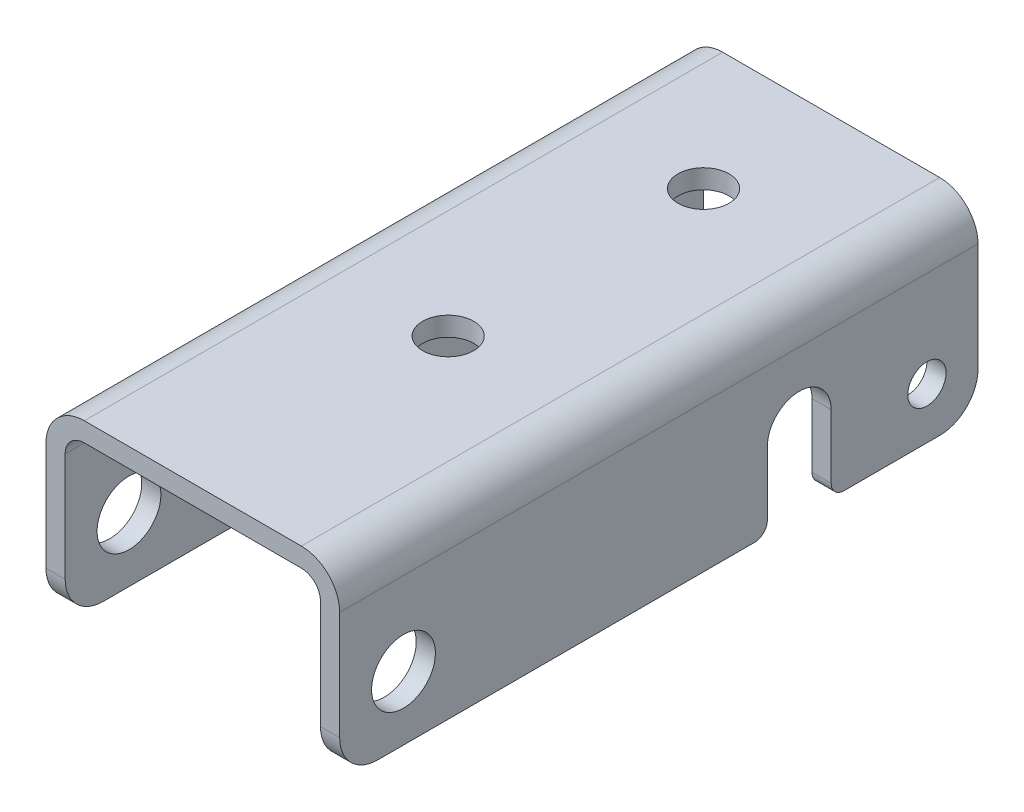
ISO-10303-21;
HEADER;
FILE_DESCRIPTION(('STEP AP214'),'2;1');
FILE_NAME('part.step','',(''),(''),'','','');
FILE_SCHEMA(('AUTOMOTIVE_DESIGN { 1 0 10303 214 1 1 1 1 }'));
ENDSEC;
DATA;
#1=APPLICATION_CONTEXT('core data for automotive mechanical design processes');
#2=APPLICATION_PROTOCOL_DEFINITION('international standard','automotive_design',2000,#1);
#3=PRODUCT_CONTEXT('',#1,'mechanical');
#4=PRODUCT('Part','Part','',(#3));
#5=PRODUCT_RELATED_PRODUCT_CATEGORY('part','',(#4));
#6=PRODUCT_DEFINITION_FORMATION('','',#4);
#7=PRODUCT_DEFINITION_CONTEXT('part definition',#1,'design');
#8=PRODUCT_DEFINITION('design','',#6,#7);
#9=PRODUCT_DEFINITION_SHAPE('','',#8);
#10=(LENGTH_UNIT() NAMED_UNIT(*) SI_UNIT(.MILLI.,.METRE.));
#11=(NAMED_UNIT(*) PLANE_ANGLE_UNIT() SI_UNIT($,.RADIAN.));
#12=(NAMED_UNIT(*) SI_UNIT($,.STERADIAN.) SOLID_ANGLE_UNIT());
#13=UNCERTAINTY_MEASURE_WITH_UNIT(LENGTH_MEASURE(1.E-05),#10,'distance_accuracy_value','');
#14=(GEOMETRIC_REPRESENTATION_CONTEXT(3) GLOBAL_UNCERTAINTY_ASSIGNED_CONTEXT((#13)) GLOBAL_UNIT_ASSIGNED_CONTEXT((#10,
#11,#12)) REPRESENTATION_CONTEXT('',''));
#15=CARTESIAN_POINT('',(0.,0.,0.));
#16=DIRECTION('',(0.,0.,1.));
#17=DIRECTION('',(1.,0.,0.));
#18=AXIS2_PLACEMENT_3D('',#15,#16,#17);
#19=CARTESIAN_POINT('',(10.,6.,-11.));
#20=DIRECTION('',(1.,0.,0.));
#21=DIRECTION('',(0.,1.,0.));
#22=AXIS2_PLACEMENT_3D('',#19,#20,#21);
#23=CYLINDRICAL_SURFACE('',#22,2.5);
#24=DIRECTION('',(-1.,0.,0.));
#25=VECTOR('',#24,1.);
#26=CARTESIAN_POINT('',(10.75,6.,-8.5));
#27=LINE('',#26,#25);
#28=CARTESIAN_POINT('',(11.5,6.,-8.5));
#29=VERTEX_POINT('',#28);
#30=CARTESIAN_POINT('',(10.,6.,-8.5));
#31=VERTEX_POINT('',#30);
#32=EDGE_CURVE('E290',#29,#31,#27,.T.);
#33=ORIENTED_EDGE('',*,*,#32,.T.);
#34=CARTESIAN_POINT('',(10.,6.,-11.));
#35=DIRECTION('',(1.,0.,0.));
#36=DIRECTION('',(0.,1.,0.));
#37=AXIS2_PLACEMENT_3D('',#34,#35,#36);
#38=CIRCLE('',#37,2.5);
#39=CARTESIAN_POINT('',(10.,6.,-13.5));
#40=VERTEX_POINT('',#39);
#41=EDGE_CURVE('E239',#31,#40,#38,.F.);
#42=ORIENTED_EDGE('',*,*,#41,.T.);
#43=DIRECTION('',(1.,0.,0.));
#44=VECTOR('',#43,1.);
#45=CARTESIAN_POINT('',(10.75,6.,-13.5));
#46=LINE('',#45,#44);
#47=CARTESIAN_POINT('',(11.5,6.,-13.5));
#48=VERTEX_POINT('',#47);
#49=EDGE_CURVE('E276',#40,#48,#46,.T.);
#50=ORIENTED_EDGE('',*,*,#49,.T.);
#51=CARTESIAN_POINT('',(11.5,6.,-11.));
#52=DIRECTION('',(1.,0.,0.));
#53=DIRECTION('',(0.,1.,0.));
#54=AXIS2_PLACEMENT_3D('',#51,#52,#53);
#55=CIRCLE('',#54,2.5);
#56=EDGE_CURVE('E397',#48,#29,#55,.T.);
#57=ORIENTED_EDGE('',*,*,#56,.T.);
#58=EDGE_LOOP('',(#33,#42,#50,#57));
#59=FACE_BOUND('',#58,.T.);
#60=ADVANCED_FACE('F17',(#59),#23,.F.);
#61=CARTESIAN_POINT('',(10.,1.,-8.5));
#62=DIRECTION('',(0.,0.,1.));
#63=DIRECTION('',(1.,0.,0.));
#64=AXIS2_PLACEMENT_3D('',#61,#62,#63);
#65=PLANE('',#64);
#66=DIRECTION('',(1.,0.,0.));
#67=VECTOR('',#66,1.);
#68=CARTESIAN_POINT('',(10.75,0.999999999820413,-8.5));
#69=LINE('',#68,#67);
#70=CARTESIAN_POINT('',(11.5,0.999999999910207,-8.5));
#71=VERTEX_POINT('',#70);
#72=CARTESIAN_POINT('',(10.,0.999999999910206,-8.5));
#73=VERTEX_POINT('',#72);
#74=EDGE_CURVE('E288',#71,#73,#69,.F.);
#75=ORIENTED_EDGE('',*,*,#74,.T.);
#76=DIRECTION('',(0.,1.,0.));
#77=VECTOR('',#76,1.);
#78=CARTESIAN_POINT('',(10.,5.75,-8.50000000000001));
#79=LINE('',#78,#77);
#80=EDGE_CURVE('E240',#73,#31,#79,.T.);
#81=ORIENTED_EDGE('',*,*,#80,.T.);
#82=ORIENTED_EDGE('',*,*,#32,.F.);
#83=DIRECTION('',(0.,-1.,0.));
#84=VECTOR('',#83,1.);
#85=CARTESIAN_POINT('',(11.5,5.75,-8.49999999999999));
#86=LINE('',#85,#84);
#87=EDGE_CURVE('E235',#29,#71,#86,.T.);
#88=ORIENTED_EDGE('',*,*,#87,.T.);
#89=EDGE_LOOP('',(#75,#81,#82,#88));
#90=FACE_BOUND('',#89,.T.);
#91=ADVANCED_FACE('F469',(#90),#65,.F.);
#92=CARTESIAN_POINT('',(10.,1.,-7.5));
#93=DIRECTION('',(1.,0.,0.));
#94=DIRECTION('',(0.,1.,0.));
#95=AXIS2_PLACEMENT_3D('',#92,#93,#94);
#96=CYLINDRICAL_SURFACE('',#95,1.);
#97=ORIENTED_EDGE('',*,*,#74,.F.);
#98=CARTESIAN_POINT('',(11.5,1.,-7.5));
#99=DIRECTION('',(1.,0.,0.));
#100=DIRECTION('',(0.,1.,0.));
#101=AXIS2_PLACEMENT_3D('',#98,#99,#100);
#102=CIRCLE('',#101,1.);
#103=CARTESIAN_POINT('',(11.5,0.,-7.5));
#104=VERTEX_POINT('',#103);
#105=EDGE_CURVE('E394',#71,#104,#102,.F.);
#106=ORIENTED_EDGE('',*,*,#105,.T.);
#107=DIRECTION('',(-1.,0.,0.));
#108=VECTOR('',#107,1.);
#109=CARTESIAN_POINT('',(10.75,0.,-7.5));
#110=LINE('',#109,#108);
#111=CARTESIAN_POINT('',(10.,0.,-7.5));
#112=VERTEX_POINT('',#111);
#113=EDGE_CURVE('E285',#104,#112,#110,.T.);
#114=ORIENTED_EDGE('',*,*,#113,.T.);
#115=CARTESIAN_POINT('',(10.,1.,-7.5));
#116=DIRECTION('',(1.,0.,0.));
#117=DIRECTION('',(0.,1.,0.));
#118=AXIS2_PLACEMENT_3D('',#115,#116,#117);
#119=CIRCLE('',#118,1.);
#120=EDGE_CURVE('E243',#112,#73,#119,.T.);
#121=ORIENTED_EDGE('',*,*,#120,.T.);
#122=EDGE_LOOP('',(#97,#106,#114,#121));
#123=FACE_BOUND('',#122,.T.);
#124=ADVANCED_FACE('F466',(#123),#96,.T.);
#125=CARTESIAN_POINT('',(10.,0.,-7.5));
#126=DIRECTION('',(0.,1.,0.));
#127=DIRECTION('',(0.,0.,1.));
#128=AXIS2_PLACEMENT_3D('',#125,#126,#127);
#129=PLANE('',#128);
#130=ORIENTED_EDGE('',*,*,#113,.F.);
#131=DIRECTION('',(0.,0.,1.));
#132=VECTOR('',#131,1.);
#133=CARTESIAN_POINT('',(11.5,0.,0.));
#134=LINE('',#133,#132);
#135=CARTESIAN_POINT('',(11.5,0.,21.999999999423));
#136=VERTEX_POINT('',#135);
#137=EDGE_CURVE('E393',#104,#136,#134,.T.);
#138=ORIENTED_EDGE('',*,*,#137,.T.);
#139=DIRECTION('',(1.,0.,0.));
#140=VECTOR('',#139,1.);
#141=CARTESIAN_POINT('',(10.75,0.,21.9999999988459));
#142=LINE('',#141,#140);
#143=CARTESIAN_POINT('',(10.,0.,21.999999999423));
#144=VERTEX_POINT('',#143);
#145=EDGE_CURVE('E282',#136,#144,#142,.F.);
#146=ORIENTED_EDGE('',*,*,#145,.T.);
#147=DIRECTION('',(0.,0.,-1.));
#148=VECTOR('',#147,1.);
#149=CARTESIAN_POINT('',(10.,0.,0.));
#150=LINE('',#149,#148);
#151=EDGE_CURVE('E244',#144,#112,#150,.T.);
#152=ORIENTED_EDGE('',*,*,#151,.T.);
#153=EDGE_LOOP('',(#130,#138,#146,#152));
#154=FACE_BOUND('',#153,.T.);
#155=ADVANCED_FACE('F457',(#154),#129,.F.);
#156=CARTESIAN_POINT('',(11.5,3.,22.));
#157=DIRECTION('',(-1.,0.,0.));
#158=DIRECTION('',(0.,0.,1.));
#159=AXIS2_PLACEMENT_3D('',#156,#157,#158);
#160=CYLINDRICAL_SURFACE('',#159,3.);
#161=ORIENTED_EDGE('',*,*,#145,.F.);
#162=CARTESIAN_POINT('',(11.5,3.,22.));
#163=DIRECTION('',(-1.,0.,0.));
#164=DIRECTION('',(0.,0.,1.));
#165=AXIS2_PLACEMENT_3D('',#162,#163,#164);
#166=CIRCLE('',#165,3.);
#167=CARTESIAN_POINT('',(11.5,2.99999999973062,25.));
#168=VERTEX_POINT('',#167);
#169=EDGE_CURVE('E390',#136,#168,#166,.T.);
#170=ORIENTED_EDGE('',*,*,#169,.T.);
#171=DIRECTION('',(-1.,0.,0.));
#172=VECTOR('',#171,1.);
#173=CARTESIAN_POINT('',(10.75,2.99999999946124,25.));
#174=LINE('',#173,#172);
#175=CARTESIAN_POINT('',(10.0000000035,2.99999999973062,25.));
#176=VERTEX_POINT('',#175);
#177=EDGE_CURVE('E283',#176,#168,#174,.F.);
#178=ORIENTED_EDGE('',*,*,#177,.F.);
#179=CARTESIAN_POINT('',(10.,3.,22.));
#180=DIRECTION('',(-1.,0.,0.));
#181=DIRECTION('',(0.,0.,1.));
#182=AXIS2_PLACEMENT_3D('',#179,#180,#181);
#183=CIRCLE('',#182,3.);
#184=EDGE_CURVE('E211',#176,#144,#183,.F.);
#185=ORIENTED_EDGE('',*,*,#184,.T.);
#186=EDGE_LOOP('',(#161,#170,#178,#185));
#187=FACE_BOUND('',#186,.T.);
#188=ADVANCED_FACE('F408',(#187),#160,.T.);
#189=CARTESIAN_POINT('',(10.,3.,-22.));
#190=DIRECTION('',(1.,0.,0.));
#191=DIRECTION('',(0.,1.,0.));
#192=AXIS2_PLACEMENT_3D('',#189,#190,#191);
#193=CYLINDRICAL_SURFACE('',#192,3.);
#194=DIRECTION('',(1.,0.,0.));
#195=VECTOR('',#194,1.);
#196=CARTESIAN_POINT('',(10.75,2.99999999946124,-25.));
#197=LINE('',#196,#195);
#198=CARTESIAN_POINT('',(11.5,2.99999999973062,-25.));
#199=VERTEX_POINT('',#198);
#200=CARTESIAN_POINT('',(10.0000000035,2.99999999973062,-25.));
#201=VERTEX_POINT('',#200);
#202=EDGE_CURVE('E222',#199,#201,#197,.F.);
#203=ORIENTED_EDGE('',*,*,#202,.F.);
#204=CARTESIAN_POINT('',(11.5,3.,-22.));
#205=DIRECTION('',(1.,0.,0.));
#206=DIRECTION('',(0.,1.,0.));
#207=AXIS2_PLACEMENT_3D('',#204,#205,#206);
#208=CIRCLE('',#207,3.);
#209=CARTESIAN_POINT('',(11.5,0.,-22.));
#210=VERTEX_POINT('',#209);
#211=EDGE_CURVE('E217',#199,#210,#208,.F.);
#212=ORIENTED_EDGE('',*,*,#211,.T.);
#213=DIRECTION('',(-1.,0.,0.));
#214=VECTOR('',#213,1.);
#215=CARTESIAN_POINT('',(10.75,0.,-22.));
#216=LINE('',#215,#214);
#217=CARTESIAN_POINT('',(10.,0.,-22.));
#218=VERTEX_POINT('',#217);
#219=EDGE_CURVE('E214',#210,#218,#216,.T.);
#220=ORIENTED_EDGE('',*,*,#219,.T.);
#221=CARTESIAN_POINT('',(10.,3.,-22.));
#222=DIRECTION('',(1.,0.,0.));
#223=DIRECTION('',(0.,1.,0.));
#224=AXIS2_PLACEMENT_3D('',#221,#222,#223);
#225=CIRCLE('',#224,3.);
#226=EDGE_CURVE('E21',#218,#201,#225,.T.);
#227=ORIENTED_EDGE('',*,*,#226,.T.);
#228=EDGE_LOOP('',(#203,#212,#220,#227));
#229=FACE_BOUND('',#228,.T.);
#230=ADVANCED_FACE('F215',(#229),#193,.T.);
#231=CARTESIAN_POINT('',(10.,0.,-22.));
#232=DIRECTION('',(0.,1.,0.));
#233=DIRECTION('',(0.,0.,1.));
#234=AXIS2_PLACEMENT_3D('',#231,#232,#233);
#235=PLANE('',#234);
#236=DIRECTION('',(1.,0.,0.));
#237=VECTOR('',#236,1.);
#238=CARTESIAN_POINT('',(10.75,0.,-14.4999999996153));
#239=LINE('',#238,#237);
#240=CARTESIAN_POINT('',(11.5,0.,-14.4999999998077));
#241=VERTEX_POINT('',#240);
#242=CARTESIAN_POINT('',(10.,0.,-14.4999999998077));
#243=VERTEX_POINT('',#242);
#244=EDGE_CURVE('E221',#241,#243,#239,.F.);
#245=ORIENTED_EDGE('',*,*,#244,.T.);
#246=DIRECTION('',(0.,0.,-1.));
#247=VECTOR('',#246,1.);
#248=CARTESIAN_POINT('',(10.,0.,0.));
#249=LINE('',#248,#247);
#250=EDGE_CURVE('E206',#243,#218,#249,.T.);
#251=ORIENTED_EDGE('',*,*,#250,.T.);
#252=ORIENTED_EDGE('',*,*,#219,.F.);
#253=DIRECTION('',(0.,0.,1.));
#254=VECTOR('',#253,1.);
#255=CARTESIAN_POINT('',(11.5,0.,0.));
#256=LINE('',#255,#254);
#257=EDGE_CURVE('E388',#210,#241,#256,.T.);
#258=ORIENTED_EDGE('',*,*,#257,.T.);
#259=EDGE_LOOP('',(#245,#251,#252,#258));
#260=FACE_BOUND('',#259,.T.);
#261=ADVANCED_FACE('F224',(#260),#235,.F.);
#262=CARTESIAN_POINT('',(10.,1.,-14.5));
#263=DIRECTION('',(1.,0.,0.));
#264=DIRECTION('',(0.,1.,0.));
#265=AXIS2_PLACEMENT_3D('',#262,#263,#264);
#266=CYLINDRICAL_SURFACE('',#265,0.999999999999999);
#267=ORIENTED_EDGE('',*,*,#244,.F.);
#268=CARTESIAN_POINT('',(11.5,1.,-14.5));
#269=DIRECTION('',(1.,0.,0.));
#270=DIRECTION('',(0.,1.,0.));
#271=AXIS2_PLACEMENT_3D('',#268,#269,#270);
#272=CIRCLE('',#271,0.999999999999999);
#273=CARTESIAN_POINT('',(11.5,1.,-13.5));
#274=VERTEX_POINT('',#273);
#275=EDGE_CURVE('E385',#241,#274,#272,.F.);
#276=ORIENTED_EDGE('',*,*,#275,.T.);
#277=DIRECTION('',(-1.,0.,0.));
#278=VECTOR('',#277,1.);
#279=CARTESIAN_POINT('',(10.75,1.,-13.5));
#280=LINE('',#279,#278);
#281=CARTESIAN_POINT('',(10.,1.,-13.5));
#282=VERTEX_POINT('',#281);
#283=EDGE_CURVE('E274',#274,#282,#280,.T.);
#284=ORIENTED_EDGE('',*,*,#283,.T.);
#285=CARTESIAN_POINT('',(10.,1.,-14.5));
#286=DIRECTION('',(1.,0.,0.));
#287=DIRECTION('',(0.,1.,0.));
#288=AXIS2_PLACEMENT_3D('',#285,#286,#287);
#289=CIRCLE('',#288,0.999999999999999);
#290=EDGE_CURVE('E226',#282,#243,#289,.T.);
#291=ORIENTED_EDGE('',*,*,#290,.T.);
#292=EDGE_LOOP('',(#267,#276,#284,#291));
#293=FACE_BOUND('',#292,.T.);
#294=ADVANCED_FACE('F476',(#293),#266,.T.);
#295=CARTESIAN_POINT('',(11.5,1.,-13.5));
#296=DIRECTION('',(0.,0.,-1.));
#297=DIRECTION('',(-1.,0.,0.));
#298=AXIS2_PLACEMENT_3D('',#295,#296,#297);
#299=PLANE('',#298);
#300=ORIENTED_EDGE('',*,*,#283,.F.);
#301=DIRECTION('',(0.,1.,0.));
#302=VECTOR('',#301,1.);
#303=CARTESIAN_POINT('',(11.5,5.75,-13.5));
#304=LINE('',#303,#302);
#305=EDGE_CURVE('E384',#274,#48,#304,.T.);
#306=ORIENTED_EDGE('',*,*,#305,.T.);
#307=ORIENTED_EDGE('',*,*,#49,.F.);
#308=DIRECTION('',(0.,-1.,0.));
#309=VECTOR('',#308,1.);
#310=CARTESIAN_POINT('',(10.,5.75,-13.5));
#311=LINE('',#310,#309);
#312=EDGE_CURVE('E231',#40,#282,#311,.T.);
#313=ORIENTED_EDGE('',*,*,#312,.T.);
#314=EDGE_LOOP('',(#300,#306,#307,#313));
#315=FACE_BOUND('',#314,.T.);
#316=ADVANCED_FACE('F477',(#315),#299,.F.);
#317=CARTESIAN_POINT('',(10.,4.,-21.));
#318=DIRECTION('',(1.,0.,0.));
#319=DIRECTION('',(0.,1.,0.));
#320=AXIS2_PLACEMENT_3D('',#317,#318,#319);
#321=CYLINDRICAL_SURFACE('',#320,1.5);
#322=CARTESIAN_POINT('',(10.,4.,-21.));
#323=DIRECTION('',(1.,0.,0.));
#324=DIRECTION('',(0.,1.,0.));
#325=AXIS2_PLACEMENT_3D('',#322,#323,#324);
#326=CIRCLE('',#325,1.5);
#327=CARTESIAN_POINT('',(10.,5.5,-21.));
#328=VERTEX_POINT('',#327);
#329=EDGE_CURVE('E225',#328,#328,#326,.F.);
#330=ORIENTED_EDGE('',*,*,#329,.T.);
#331=EDGE_LOOP('',(#330));
#332=FACE_BOUND('',#331,.T.);
#333=CARTESIAN_POINT('',(11.5,4.,-21.));
#334=DIRECTION('',(1.,0.,0.));
#335=DIRECTION('',(0.,1.,0.));
#336=AXIS2_PLACEMENT_3D('',#333,#334,#335);
#337=CIRCLE('',#336,1.5);
#338=CARTESIAN_POINT('',(11.5,5.5,-21.));
#339=VERTEX_POINT('',#338);
#340=EDGE_CURVE('E381',#339,#339,#337,.T.);
#341=ORIENTED_EDGE('',*,*,#340,.T.);
#342=EDGE_LOOP('',(#341));
#343=FACE_BOUND('',#342,.T.);
#344=ADVANCED_FACE('F479',(#332,#343),#321,.F.);
#345=CARTESIAN_POINT('',(10.,5.,20.));
#346=DIRECTION('',(1.,0.,0.));
#347=DIRECTION('',(0.,1.,0.));
#348=AXIS2_PLACEMENT_3D('',#345,#346,#347);
#349=CYLINDRICAL_SURFACE('',#348,2.5);
#350=CARTESIAN_POINT('',(10.,5.,20.));
#351=DIRECTION('',(1.,0.,0.));
#352=DIRECTION('',(0.,1.,0.));
#353=AXIS2_PLACEMENT_3D('',#350,#351,#352);
#354=CIRCLE('',#353,2.5);
#355=CARTESIAN_POINT('',(10.,7.5,20.));
#356=VERTEX_POINT('',#355);
#357=EDGE_CURVE('E229',#356,#356,#354,.F.);
#358=ORIENTED_EDGE('',*,*,#357,.T.);
#359=EDGE_LOOP('',(#358));
#360=FACE_BOUND('',#359,.T.);
#361=CARTESIAN_POINT('',(11.5,5.,20.));
#362=DIRECTION('',(1.,0.,0.));
#363=DIRECTION('',(0.,1.,0.));
#364=AXIS2_PLACEMENT_3D('',#361,#362,#363);
#365=CIRCLE('',#364,2.5);
#366=CARTESIAN_POINT('',(11.5,7.5,20.));
#367=VERTEX_POINT('',#366);
#368=EDGE_CURVE('E378',#367,#367,#365,.T.);
#369=ORIENTED_EDGE('',*,*,#368,.T.);
#370=EDGE_LOOP('',(#369));
#371=FACE_BOUND('',#370,.T.);
#372=ADVANCED_FACE('F486',(#360,#371),#349,.F.);
#373=CARTESIAN_POINT('',(-11.5,6.,-11.));
#374=DIRECTION('',(1.,0.,0.));
#375=DIRECTION('',(0.,0.,-1.));
#376=AXIS2_PLACEMENT_3D('',#373,#374,#375);
#377=CYLINDRICAL_SURFACE('',#376,2.5);
#378=DIRECTION('',(1.,0.,0.));
#379=VECTOR('',#378,1.);
#380=CARTESIAN_POINT('',(-10.75,6.,-13.5));
#381=LINE('',#380,#379);
#382=CARTESIAN_POINT('',(-11.5,6.,-13.5));
#383=VERTEX_POINT('',#382);
#384=CARTESIAN_POINT('',(-10.,6.,-13.5));
#385=VERTEX_POINT('',#384);
#386=EDGE_CURVE('E254',#383,#385,#381,.T.);
#387=ORIENTED_EDGE('',*,*,#386,.T.);
#388=CARTESIAN_POINT('',(-10.,6.,-11.));
#389=DIRECTION('',(1.,0.,0.));
#390=DIRECTION('',(0.,0.,-1.));
#391=AXIS2_PLACEMENT_3D('',#388,#389,#390);
#392=CIRCLE('',#391,2.5);
#393=CARTESIAN_POINT('',(-10.,6.,-8.5));
#394=VERTEX_POINT('',#393);
#395=EDGE_CURVE('E350',#385,#394,#392,.T.);
#396=ORIENTED_EDGE('',*,*,#395,.T.);
#397=DIRECTION('',(-1.,0.,0.));
#398=VECTOR('',#397,1.);
#399=CARTESIAN_POINT('',(-10.75,6.,-8.5));
#400=LINE('',#399,#398);
#401=CARTESIAN_POINT('',(-11.5,6.,-8.5));
#402=VERTEX_POINT('',#401);
#403=EDGE_CURVE('E272',#394,#402,#400,.T.);
#404=ORIENTED_EDGE('',*,*,#403,.T.);
#405=CARTESIAN_POINT('',(-11.5,6.,-11.));
#406=DIRECTION('',(1.,0.,0.));
#407=DIRECTION('',(0.,0.,-1.));
#408=AXIS2_PLACEMENT_3D('',#405,#406,#407);
#409=CIRCLE('',#408,2.5);
#410=EDGE_CURVE('E364',#402,#383,#409,.F.);
#411=ORIENTED_EDGE('',*,*,#410,.T.);
#412=EDGE_LOOP('',(#387,#396,#404,#411));
#413=FACE_BOUND('',#412,.T.);
#414=ADVANCED_FACE('F553',(#413),#377,.F.);
#415=CARTESIAN_POINT('',(-11.5,1.,-8.5));
#416=DIRECTION('',(0.,0.,1.));
#417=DIRECTION('',(1.,0.,0.));
#418=AXIS2_PLACEMENT_3D('',#415,#416,#417);
#419=PLANE('',#418);
#420=DIRECTION('',(1.,0.,0.));
#421=VECTOR('',#420,1.);
#422=CARTESIAN_POINT('',(-10.75,0.999999999820413,-8.5));
#423=LINE('',#422,#421);
#424=CARTESIAN_POINT('',(-10.,0.999999999910206,-8.5));
#425=VERTEX_POINT('',#424);
#426=CARTESIAN_POINT('',(-11.5,0.999999999910206,-8.5));
#427=VERTEX_POINT('',#426);
#428=EDGE_CURVE('E270',#425,#427,#423,.F.);
#429=ORIENTED_EDGE('',*,*,#428,.T.);
#430=DIRECTION('',(0.,1.,0.));
#431=VECTOR('',#430,1.);
#432=CARTESIAN_POINT('',(-11.5,5.75,-8.50000000000001));
#433=LINE('',#432,#431);
#434=EDGE_CURVE('E367',#427,#402,#433,.T.);
#435=ORIENTED_EDGE('',*,*,#434,.T.);
#436=ORIENTED_EDGE('',*,*,#403,.F.);
#437=DIRECTION('',(0.,-1.,0.));
#438=VECTOR('',#437,1.);
#439=CARTESIAN_POINT('',(-10.,5.75,-8.49999999999999));
#440=LINE('',#439,#438);
#441=EDGE_CURVE('E349',#394,#425,#440,.T.);
#442=ORIENTED_EDGE('',*,*,#441,.T.);
#443=EDGE_LOOP('',(#429,#435,#436,#442));
#444=FACE_BOUND('',#443,.T.);
#445=ADVANCED_FACE('F551',(#444),#419,.F.);
#446=CARTESIAN_POINT('',(-11.5,1.,-7.5));
#447=DIRECTION('',(1.,0.,0.));
#448=DIRECTION('',(0.,0.,-1.));
#449=AXIS2_PLACEMENT_3D('',#446,#447,#448);
#450=CYLINDRICAL_SURFACE('',#449,1.);
#451=ORIENTED_EDGE('',*,*,#428,.F.);
#452=CARTESIAN_POINT('',(-10.,1.,-7.5));
#453=DIRECTION('',(1.,0.,0.));
#454=DIRECTION('',(0.,0.,-1.));
#455=AXIS2_PLACEMENT_3D('',#452,#453,#454);
#456=CIRCLE('',#455,1.);
#457=CARTESIAN_POINT('',(-10.,0.,-7.5));
#458=VERTEX_POINT('',#457);
#459=EDGE_CURVE('E346',#425,#458,#456,.F.);
#460=ORIENTED_EDGE('',*,*,#459,.T.);
#461=DIRECTION('',(-1.,0.,0.));
#462=VECTOR('',#461,1.);
#463=CARTESIAN_POINT('',(-10.75,0.,-7.5));
#464=LINE('',#463,#462);
#465=CARTESIAN_POINT('',(-11.5,0.,-7.5));
#466=VERTEX_POINT('',#465);
#467=EDGE_CURVE('E267',#458,#466,#464,.T.);
#468=ORIENTED_EDGE('',*,*,#467,.T.);
#469=CARTESIAN_POINT('',(-11.5,1.,-7.5));
#470=DIRECTION('',(1.,0.,0.));
#471=DIRECTION('',(0.,0.,-1.));
#472=AXIS2_PLACEMENT_3D('',#469,#470,#471);
#473=CIRCLE('',#472,1.);
#474=EDGE_CURVE('E368',#466,#427,#473,.T.);
#475=ORIENTED_EDGE('',*,*,#474,.T.);
#476=EDGE_LOOP('',(#451,#460,#468,#475));
#477=FACE_BOUND('',#476,.T.);
#478=ADVANCED_FACE('F548',(#477),#450,.T.);
#479=CARTESIAN_POINT('',(-11.5,0.,-7.5));
#480=DIRECTION('',(0.,1.,0.));
#481=DIRECTION('',(0.,0.,1.));
#482=AXIS2_PLACEMENT_3D('',#479,#480,#481);
#483=PLANE('',#482);
#484=ORIENTED_EDGE('',*,*,#467,.F.);
#485=DIRECTION('',(0.,0.,1.));
#486=VECTOR('',#485,1.);
#487=CARTESIAN_POINT('',(-10.,0.,0.));
#488=LINE('',#487,#486);
#489=CARTESIAN_POINT('',(-10.,0.,21.999999999423));
#490=VERTEX_POINT('',#489);
#491=EDGE_CURVE('E345',#458,#490,#488,.T.);
#492=ORIENTED_EDGE('',*,*,#491,.T.);
#493=DIRECTION('',(1.,0.,0.));
#494=VECTOR('',#493,1.);
#495=CARTESIAN_POINT('',(-10.75,0.,21.9999999988459));
#496=LINE('',#495,#494);
#497=CARTESIAN_POINT('',(-11.5,0.,21.999999999423));
#498=VERTEX_POINT('',#497);
#499=EDGE_CURVE('E264',#490,#498,#496,.F.);
#500=ORIENTED_EDGE('',*,*,#499,.T.);
#501=DIRECTION('',(0.,0.,-1.));
#502=VECTOR('',#501,1.);
#503=CARTESIAN_POINT('',(-11.5,0.,0.));
#504=LINE('',#503,#502);
#505=EDGE_CURVE('E371',#498,#466,#504,.T.);
#506=ORIENTED_EDGE('',*,*,#505,.T.);
#507=EDGE_LOOP('',(#484,#492,#500,#506));
#508=FACE_BOUND('',#507,.T.);
#509=ADVANCED_FACE('F546',(#508),#483,.F.);
#510=CARTESIAN_POINT('',(-10.,3.,22.));
#511=DIRECTION('',(-1.,0.,0.));
#512=DIRECTION('',(0.,-1.,0.));
#513=AXIS2_PLACEMENT_3D('',#510,#511,#512);
#514=CYLINDRICAL_SURFACE('',#513,3.);
#515=ORIENTED_EDGE('',*,*,#499,.F.);
#516=CARTESIAN_POINT('',(-10.,3.,22.));
#517=DIRECTION('',(-1.,0.,0.));
#518=DIRECTION('',(0.,-1.,0.));
#519=AXIS2_PLACEMENT_3D('',#516,#517,#518);
#520=CIRCLE('',#519,3.);
#521=CARTESIAN_POINT('',(-10.0000000035,2.99999999973062,25.));
#522=VERTEX_POINT('',#521);
#523=EDGE_CURVE('E342',#490,#522,#520,.T.);
#524=ORIENTED_EDGE('',*,*,#523,.T.);
#525=DIRECTION('',(-1.,0.,0.));
#526=VECTOR('',#525,1.);
#527=CARTESIAN_POINT('',(-10.75,2.99999999946124,25.));
#528=LINE('',#527,#526);
#529=CARTESIAN_POINT('',(-11.5,2.99999999973062,25.));
#530=VERTEX_POINT('',#529);
#531=EDGE_CURVE('E265',#530,#522,#528,.F.);
#532=ORIENTED_EDGE('',*,*,#531,.F.);
#533=CARTESIAN_POINT('',(-11.5,3.,22.));
#534=DIRECTION('',(-1.,0.,0.));
#535=DIRECTION('',(0.,-1.,0.));
#536=AXIS2_PLACEMENT_3D('',#533,#534,#535);
#537=CIRCLE('',#536,3.);
#538=EDGE_CURVE('E372',#530,#498,#537,.F.);
#539=ORIENTED_EDGE('',*,*,#538,.T.);
#540=EDGE_LOOP('',(#515,#524,#532,#539));
#541=FACE_BOUND('',#540,.T.);
#542=ADVANCED_FACE('F542',(#541),#514,.T.);
#543=CARTESIAN_POINT('',(-11.5,3.,-22.));
#544=DIRECTION('',(1.,0.,0.));
#545=DIRECTION('',(0.,0.,-1.));
#546=AXIS2_PLACEMENT_3D('',#543,#544,#545);
#547=CYLINDRICAL_SURFACE('',#546,3.);
#548=DIRECTION('',(1.,0.,0.));
#549=VECTOR('',#548,1.);
#550=CARTESIAN_POINT('',(-10.75,2.99999999946124,-25.));
#551=LINE('',#550,#549);
#552=CARTESIAN_POINT('',(-10.0000000035,2.99999999973062,-25.));
#553=VERTEX_POINT('',#552);
#554=CARTESIAN_POINT('',(-11.5,2.99999999973062,-25.));
#555=VERTEX_POINT('',#554);
#556=EDGE_CURVE('E262',#553,#555,#551,.F.);
#557=ORIENTED_EDGE('',*,*,#556,.F.);
#558=CARTESIAN_POINT('',(-10.,3.,-22.));
#559=DIRECTION('',(1.,0.,0.));
#560=DIRECTION('',(0.,0.,-1.));
#561=AXIS2_PLACEMENT_3D('',#558,#559,#560);
#562=CIRCLE('',#561,3.);
#563=CARTESIAN_POINT('',(-10.,0.,-22.));
#564=VERTEX_POINT('',#563);
#565=EDGE_CURVE('E339',#553,#564,#562,.F.);
#566=ORIENTED_EDGE('',*,*,#565,.T.);
#567=DIRECTION('',(-1.,0.,0.));
#568=VECTOR('',#567,1.);
#569=CARTESIAN_POINT('',(-10.75,0.,-22.));
#570=LINE('',#569,#568);
#571=CARTESIAN_POINT('',(-11.5,0.,-22.));
#572=VERTEX_POINT('',#571);
#573=EDGE_CURVE('E259',#564,#572,#570,.T.);
#574=ORIENTED_EDGE('',*,*,#573,.T.);
#575=CARTESIAN_POINT('',(-11.5,3.,-22.));
#576=DIRECTION('',(1.,0.,0.));
#577=DIRECTION('',(0.,0.,-1.));
#578=AXIS2_PLACEMENT_3D('',#575,#576,#577);
#579=CIRCLE('',#578,3.);
#580=EDGE_CURVE('E375',#572,#555,#579,.T.);
#581=ORIENTED_EDGE('',*,*,#580,.T.);
#582=EDGE_LOOP('',(#557,#566,#574,#581));
#583=FACE_BOUND('',#582,.T.);
#584=ADVANCED_FACE('F539',(#583),#547,.T.);
#585=CARTESIAN_POINT('',(-11.5,0.,-22.));
#586=DIRECTION('',(0.,1.,0.));
#587=DIRECTION('',(0.,0.,1.));
#588=AXIS2_PLACEMENT_3D('',#585,#586,#587);
#589=PLANE('',#588);
#590=DIRECTION('',(1.,0.,0.));
#591=VECTOR('',#590,1.);
#592=CARTESIAN_POINT('',(-10.75,0.,-14.4999999996153));
#593=LINE('',#592,#591);
#594=CARTESIAN_POINT('',(-10.,0.,-14.4999999998077));
#595=VERTEX_POINT('',#594);
#596=CARTESIAN_POINT('',(-11.5,0.,-14.4999999998077));
#597=VERTEX_POINT('',#596);
#598=EDGE_CURVE('E257',#595,#597,#593,.F.);
#599=ORIENTED_EDGE('',*,*,#598,.T.);
#600=DIRECTION('',(0.,0.,-1.));
#601=VECTOR('',#600,1.);
#602=CARTESIAN_POINT('',(-11.5,0.,0.));
#603=LINE('',#602,#601);
#604=EDGE_CURVE('E359',#597,#572,#603,.T.);
#605=ORIENTED_EDGE('',*,*,#604,.T.);
#606=ORIENTED_EDGE('',*,*,#573,.F.);
#607=DIRECTION('',(0.,0.,1.));
#608=VECTOR('',#607,1.);
#609=CARTESIAN_POINT('',(-10.,0.,0.));
#610=LINE('',#609,#608);
#611=EDGE_CURVE('E338',#564,#595,#610,.T.);
#612=ORIENTED_EDGE('',*,*,#611,.T.);
#613=EDGE_LOOP('',(#599,#605,#606,#612));
#614=FACE_BOUND('',#613,.T.);
#615=ADVANCED_FACE('F537',(#614),#589,.F.);
#616=CARTESIAN_POINT('',(-11.5,1.,-14.5));
#617=DIRECTION('',(1.,0.,0.));
#618=DIRECTION('',(0.,0.,-1.));
#619=AXIS2_PLACEMENT_3D('',#616,#617,#618);
#620=CYLINDRICAL_SURFACE('',#619,0.999999999999999);
#621=ORIENTED_EDGE('',*,*,#598,.F.);
#622=CARTESIAN_POINT('',(-10.,1.,-14.5));
#623=DIRECTION('',(1.,0.,0.));
#624=DIRECTION('',(0.,0.,-1.));
#625=AXIS2_PLACEMENT_3D('',#622,#623,#624);
#626=CIRCLE('',#625,0.999999999999999);
#627=CARTESIAN_POINT('',(-10.,1.,-13.5));
#628=VERTEX_POINT('',#627);
#629=EDGE_CURVE('E335',#595,#628,#626,.F.);
#630=ORIENTED_EDGE('',*,*,#629,.T.);
#631=DIRECTION('',(-1.,0.,0.));
#632=VECTOR('',#631,1.);
#633=CARTESIAN_POINT('',(-10.75,1.,-13.5));
#634=LINE('',#633,#632);
#635=CARTESIAN_POINT('',(-11.5,1.,-13.5));
#636=VERTEX_POINT('',#635);
#637=EDGE_CURVE('E212',#628,#636,#634,.T.);
#638=ORIENTED_EDGE('',*,*,#637,.T.);
#639=CARTESIAN_POINT('',(-11.5,1.,-14.5));
#640=DIRECTION('',(1.,0.,0.));
#641=DIRECTION('',(0.,0.,-1.));
#642=AXIS2_PLACEMENT_3D('',#639,#640,#641);
#643=CIRCLE('',#642,0.999999999999999);
#644=EDGE_CURVE('E360',#636,#597,#643,.T.);
#645=ORIENTED_EDGE('',*,*,#644,.T.);
#646=EDGE_LOOP('',(#621,#630,#638,#645));
#647=FACE_BOUND('',#646,.T.);
#648=ADVANCED_FACE('F534',(#647),#620,.T.);
#649=CARTESIAN_POINT('',(-10.,1.,-13.5));
#650=DIRECTION('',(0.,0.,-1.));
#651=DIRECTION('',(-1.,0.,0.));
#652=AXIS2_PLACEMENT_3D('',#649,#650,#651);
#653=PLANE('',#652);
#654=ORIENTED_EDGE('',*,*,#637,.F.);
#655=DIRECTION('',(0.,1.,0.));
#656=VECTOR('',#655,1.);
#657=CARTESIAN_POINT('',(-10.,5.75,-13.5));
#658=LINE('',#657,#656);
#659=EDGE_CURVE('E334',#628,#385,#658,.T.);
#660=ORIENTED_EDGE('',*,*,#659,.T.);
#661=ORIENTED_EDGE('',*,*,#386,.F.);
#662=DIRECTION('',(0.,-1.,0.));
#663=VECTOR('',#662,1.);
#664=CARTESIAN_POINT('',(-11.5,5.75,-13.5));
#665=LINE('',#664,#663);
#666=EDGE_CURVE('E363',#383,#636,#665,.T.);
#667=ORIENTED_EDGE('',*,*,#666,.T.);
#668=EDGE_LOOP('',(#654,#660,#661,#667));
#669=FACE_BOUND('',#668,.T.);
#670=ADVANCED_FACE('F532',(#669),#653,.F.);
#671=CARTESIAN_POINT('',(-11.5,4.,-21.));
#672=DIRECTION('',(1.,0.,0.));
#673=DIRECTION('',(0.,0.,-1.));
#674=AXIS2_PLACEMENT_3D('',#671,#672,#673);
#675=CYLINDRICAL_SURFACE('',#674,1.5);
#676=CARTESIAN_POINT('',(-10.,4.,-21.));
#677=DIRECTION('',(1.,0.,0.));
#678=DIRECTION('',(0.,0.,-1.));
#679=AXIS2_PLACEMENT_3D('',#676,#677,#678);
#680=CIRCLE('',#679,1.5);
#681=CARTESIAN_POINT('',(-10.,4.,-22.5));
#682=VERTEX_POINT('',#681);
#683=EDGE_CURVE('E331',#682,#682,#680,.T.);
#684=ORIENTED_EDGE('',*,*,#683,.T.);
#685=EDGE_LOOP('',(#684));
#686=FACE_BOUND('',#685,.T.);
#687=CARTESIAN_POINT('',(-11.5,4.,-21.));
#688=DIRECTION('',(1.,0.,0.));
#689=DIRECTION('',(0.,0.,-1.));
#690=AXIS2_PLACEMENT_3D('',#687,#688,#689);
#691=CIRCLE('',#690,1.5);
#692=CARTESIAN_POINT('',(-11.5,4.,-22.5));
#693=VERTEX_POINT('',#692);
#694=EDGE_CURVE('E356',#693,#693,#691,.F.);
#695=ORIENTED_EDGE('',*,*,#694,.T.);
#696=EDGE_LOOP('',(#695));
#697=FACE_BOUND('',#696,.T.);
#698=ADVANCED_FACE('F528',(#686,#697),#675,.F.);
#699=CARTESIAN_POINT('',(-11.5,5.,20.));
#700=DIRECTION('',(1.,0.,0.));
#701=DIRECTION('',(0.,0.,-1.));
#702=AXIS2_PLACEMENT_3D('',#699,#700,#701);
#703=CYLINDRICAL_SURFACE('',#702,2.5);
#704=CARTESIAN_POINT('',(-10.,5.,20.));
#705=DIRECTION('',(1.,0.,0.));
#706=DIRECTION('',(0.,0.,-1.));
#707=AXIS2_PLACEMENT_3D('',#704,#705,#706);
#708=CIRCLE('',#707,2.5);
#709=CARTESIAN_POINT('',(-10.,5.,17.5));
#710=VERTEX_POINT('',#709);
#711=EDGE_CURVE('E252',#710,#710,#708,.T.);
#712=ORIENTED_EDGE('',*,*,#711,.T.);
#713=EDGE_LOOP('',(#712));
#714=FACE_BOUND('',#713,.T.);
#715=CARTESIAN_POINT('',(-11.5,5.,20.));
#716=DIRECTION('',(1.,0.,0.));
#717=DIRECTION('',(0.,0.,-1.));
#718=AXIS2_PLACEMENT_3D('',#715,#716,#717);
#719=CIRCLE('',#718,2.5);
#720=CARTESIAN_POINT('',(-11.5,5.,17.5));
#721=VERTEX_POINT('',#720);
#722=EDGE_CURVE('E353',#721,#721,#719,.F.);
#723=ORIENTED_EDGE('',*,*,#722,.T.);
#724=EDGE_LOOP('',(#723));
#725=FACE_BOUND('',#724,.T.);
#726=ADVANCED_FACE('F525',(#714,#725),#703,.F.);
#727=CARTESIAN_POINT('',(10.,0.,25.));
#728=DIRECTION('',(1.,0.,0.));
#729=DIRECTION('',(0.,0.,-1.));
#730=AXIS2_PLACEMENT_3D('',#727,#728,#729);
#731=PLANE('',#730);
#732=ORIENTED_EDGE('',*,*,#357,.F.);
#733=EDGE_LOOP('',(#732));
#734=FACE_BOUND('',#733,.T.);
#735=ORIENTED_EDGE('',*,*,#329,.F.);
#736=EDGE_LOOP('',(#735));
#737=FACE_BOUND('',#736,.T.);
#738=ORIENTED_EDGE('',*,*,#290,.F.);
#739=ORIENTED_EDGE('',*,*,#312,.F.);
#740=ORIENTED_EDGE('',*,*,#41,.F.);
#741=ORIENTED_EDGE('',*,*,#80,.F.);
#742=ORIENTED_EDGE('',*,*,#120,.F.);
#743=ORIENTED_EDGE('',*,*,#151,.F.);
#744=ORIENTED_EDGE('',*,*,#184,.F.);
#745=DIRECTION('',(0.,-1.,0.));
#746=VECTOR('',#745,1.);
#747=CARTESIAN_POINT('',(10.000000007,8.75,25.));
#748=LINE('',#747,#746);
#749=CARTESIAN_POINT('',(10.0000000035,11.4999999996923,25.));
#750=VERTEX_POINT('',#749);
#751=EDGE_CURVE('E413',#750,#176,#748,.T.);
#752=ORIENTED_EDGE('',*,*,#751,.F.);
#753=DIRECTION('',(0.,0.,-1.));
#754=VECTOR('',#753,1.);
#755=CARTESIAN_POINT('',(10.,11.4999999993847,0.));
#756=LINE('',#755,#754);
#757=CARTESIAN_POINT('',(10.0000000035,11.4999999996923,-25.));
#758=VERTEX_POINT('',#757);
#759=EDGE_CURVE('E247',#758,#750,#756,.F.);
#760=ORIENTED_EDGE('',*,*,#759,.F.);
#761=DIRECTION('',(0.,-1.,0.));
#762=VECTOR('',#761,1.);
#763=CARTESIAN_POINT('',(10.000000007,8.75,-25.));
#764=LINE('',#763,#762);
#765=EDGE_CURVE('E209',#758,#201,#764,.T.);
#766=ORIENTED_EDGE('',*,*,#765,.T.);
#767=ORIENTED_EDGE('',*,*,#226,.F.);
#768=ORIENTED_EDGE('',*,*,#250,.F.);
#769=EDGE_LOOP('',(#738,#739,#740,#741,#742,#743,#744,#752,#760,#766,#767,#768));
#770=FACE_BOUND('',#769,.T.);
#771=ADVANCED_FACE('F204',(#734,#737,#770),#731,.F.);
#772=CARTESIAN_POINT('',(11.5,0.,-25.));
#773=DIRECTION('',(-1.,0.,0.));
#774=DIRECTION('',(0.,0.,1.));
#775=AXIS2_PLACEMENT_3D('',#772,#773,#774);
#776=PLANE('',#775);
#777=ORIENTED_EDGE('',*,*,#368,.F.);
#778=EDGE_LOOP('',(#777));
#779=FACE_BOUND('',#778,.T.);
#780=ORIENTED_EDGE('',*,*,#340,.F.);
#781=EDGE_LOOP('',(#780));
#782=FACE_BOUND('',#781,.T.);
#783=ORIENTED_EDGE('',*,*,#275,.F.);
#784=ORIENTED_EDGE('',*,*,#257,.F.);
#785=ORIENTED_EDGE('',*,*,#211,.F.);
#786=DIRECTION('',(0.,1.,0.));
#787=VECTOR('',#786,1.);
#788=CARTESIAN_POINT('',(11.5,8.75,-25.));
#789=LINE('',#788,#787);
#790=CARTESIAN_POINT('',(11.5,11.4999999993847,-25.));
#791=VERTEX_POINT('',#790);
#792=EDGE_CURVE('E308',#199,#791,#789,.T.);
#793=ORIENTED_EDGE('',*,*,#792,.T.);
#794=DIRECTION('',(0.,0.,-1.));
#795=VECTOR('',#794,1.);
#796=CARTESIAN_POINT('',(11.5,11.4999999987694,0.));
#797=LINE('',#796,#795);
#798=CARTESIAN_POINT('',(11.5,11.4999999993847,25.));
#799=VERTEX_POINT('',#798);
#800=EDGE_CURVE('E249',#791,#799,#797,.F.);
#801=ORIENTED_EDGE('',*,*,#800,.T.);
#802=DIRECTION('',(0.,1.,0.));
#803=VECTOR('',#802,1.);
#804=CARTESIAN_POINT('',(11.5,8.75,25.));
#805=LINE('',#804,#803);
#806=EDGE_CURVE('E328',#168,#799,#805,.T.);
#807=ORIENTED_EDGE('',*,*,#806,.F.);
#808=ORIENTED_EDGE('',*,*,#169,.F.);
#809=ORIENTED_EDGE('',*,*,#137,.F.);
#810=ORIENTED_EDGE('',*,*,#105,.F.);
#811=ORIENTED_EDGE('',*,*,#87,.F.);
#812=ORIENTED_EDGE('',*,*,#56,.F.);
#813=ORIENTED_EDGE('',*,*,#305,.F.);
#814=EDGE_LOOP('',(#783,#784,#785,#793,#801,#807,#808,#809,#810,#811,#812,#813));
#815=FACE_BOUND('',#814,.T.);
#816=ADVANCED_FACE('F461',(#779,#782,#815),#776,.F.);
#817=CARTESIAN_POINT('',(-11.5,0.,25.));
#818=DIRECTION('',(1.,0.,0.));
#819=DIRECTION('',(0.,0.,-1.));
#820=AXIS2_PLACEMENT_3D('',#817,#818,#819);
#821=PLANE('',#820);
#822=ORIENTED_EDGE('',*,*,#722,.F.);
#823=EDGE_LOOP('',(#822));
#824=FACE_BOUND('',#823,.T.);
#825=ORIENTED_EDGE('',*,*,#694,.F.);
#826=EDGE_LOOP('',(#825));
#827=FACE_BOUND('',#826,.T.);
#828=ORIENTED_EDGE('',*,*,#644,.F.);
#829=ORIENTED_EDGE('',*,*,#666,.F.);
#830=ORIENTED_EDGE('',*,*,#410,.F.);
#831=ORIENTED_EDGE('',*,*,#434,.F.);
#832=ORIENTED_EDGE('',*,*,#474,.F.);
#833=ORIENTED_EDGE('',*,*,#505,.F.);
#834=ORIENTED_EDGE('',*,*,#538,.F.);
#835=DIRECTION('',(0.,-1.,0.));
#836=VECTOR('',#835,1.);
#837=CARTESIAN_POINT('',(-11.5,8.75,25.));
#838=LINE('',#837,#836);
#839=CARTESIAN_POINT('',(-11.5,11.5,25.));
#840=VERTEX_POINT('',#839);
#841=EDGE_CURVE('E327',#840,#530,#838,.T.);
#842=ORIENTED_EDGE('',*,*,#841,.F.);
#843=DIRECTION('',(0.,0.,1.));
#844=VECTOR('',#843,1.);
#845=CARTESIAN_POINT('',(-11.5,11.5,0.));
#846=LINE('',#845,#844);
#847=CARTESIAN_POINT('',(-11.5,11.5,-25.));
#848=VERTEX_POINT('',#847);
#849=EDGE_CURVE('E315',#840,#848,#846,.F.);
#850=ORIENTED_EDGE('',*,*,#849,.T.);
#851=DIRECTION('',(0.,-1.,0.));
#852=VECTOR('',#851,1.);
#853=CARTESIAN_POINT('',(-11.5,8.75,-25.));
#854=LINE('',#853,#852);
#855=EDGE_CURVE('E304',#848,#555,#854,.T.);
#856=ORIENTED_EDGE('',*,*,#855,.T.);
#857=ORIENTED_EDGE('',*,*,#580,.F.);
#858=ORIENTED_EDGE('',*,*,#604,.F.);
#859=EDGE_LOOP('',(#828,#829,#830,#831,#832,#833,#834,#842,#850,#856,#857,#858));
#860=FACE_BOUND('',#859,.T.);
#861=ADVANCED_FACE('F696',(#824,#827,#860),#821,.F.);
#862=CARTESIAN_POINT('',(-10.,0.,-25.));
#863=DIRECTION('',(-1.,0.,0.));
#864=DIRECTION('',(0.,0.,1.));
#865=AXIS2_PLACEMENT_3D('',#862,#863,#864);
#866=PLANE('',#865);
#867=ORIENTED_EDGE('',*,*,#711,.F.);
#868=EDGE_LOOP('',(#867));
#869=FACE_BOUND('',#868,.T.);
#870=ORIENTED_EDGE('',*,*,#683,.F.);
#871=EDGE_LOOP('',(#870));
#872=FACE_BOUND('',#871,.T.);
#873=ORIENTED_EDGE('',*,*,#629,.F.);
#874=ORIENTED_EDGE('',*,*,#611,.F.);
#875=ORIENTED_EDGE('',*,*,#565,.F.);
#876=DIRECTION('',(0.,1.,0.));
#877=VECTOR('',#876,1.);
#878=CARTESIAN_POINT('',(-10.000000007,8.75,-25.));
#879=LINE('',#878,#877);
#880=CARTESIAN_POINT('',(-10.0000000035,11.5,-25.));
#881=VERTEX_POINT('',#880);
#882=EDGE_CURVE('E433',#553,#881,#879,.T.);
#883=ORIENTED_EDGE('',*,*,#882,.T.);
#884=DIRECTION('',(0.,0.,1.));
#885=VECTOR('',#884,1.);
#886=CARTESIAN_POINT('',(-10.,11.5,0.));
#887=LINE('',#886,#885);
#888=CARTESIAN_POINT('',(-10.0000000035,11.5,25.));
#889=VERTEX_POINT('',#888);
#890=EDGE_CURVE('E250',#889,#881,#887,.F.);
#891=ORIENTED_EDGE('',*,*,#890,.F.);
#892=DIRECTION('',(0.,1.,0.));
#893=VECTOR('',#892,1.);
#894=CARTESIAN_POINT('',(-10.000000007,8.75,25.));
#895=LINE('',#894,#893);
#896=EDGE_CURVE('E324',#522,#889,#895,.T.);
#897=ORIENTED_EDGE('',*,*,#896,.F.);
#898=ORIENTED_EDGE('',*,*,#523,.F.);
#899=ORIENTED_EDGE('',*,*,#491,.F.);
#900=ORIENTED_EDGE('',*,*,#459,.F.);
#901=ORIENTED_EDGE('',*,*,#441,.F.);
#902=ORIENTED_EDGE('',*,*,#395,.F.);
#903=ORIENTED_EDGE('',*,*,#659,.F.);
#904=EDGE_LOOP('',(#873,#874,#875,#883,#891,#897,#898,#899,#900,#901,#902,#903));
#905=FACE_BOUND('',#904,.T.);
#906=ADVANCED_FACE('F523',(#869,#872,#905),#866,.F.);
#907=CARTESIAN_POINT('',(-8.5,11.5,25.));
#908=DIRECTION('',(0.,0.,-1.));
#909=DIRECTION('',(-1.,0.,0.));
#910=AXIS2_PLACEMENT_3D('',#907,#908,#909);
#911=CYLINDRICAL_SURFACE('',#910,1.5);
#912=CARTESIAN_POINT('',(-8.5,11.5,25.));
#913=DIRECTION('',(0.,0.,-1.));
#914=DIRECTION('',(-1.,0.,0.));
#915=AXIS2_PLACEMENT_3D('',#912,#913,#914);
#916=CIRCLE('',#915,1.5);
#917=CARTESIAN_POINT('',(-8.5,13.,25.));
#918=VERTEX_POINT('',#917);
#919=EDGE_CURVE('E322',#889,#918,#916,.T.);
#920=ORIENTED_EDGE('',*,*,#919,.F.);
#921=ORIENTED_EDGE('',*,*,#890,.T.);
#922=CARTESIAN_POINT('',(-8.5,11.5,-25.));
#923=DIRECTION('',(0.,0.,-1.));
#924=DIRECTION('',(-1.,0.,0.));
#925=AXIS2_PLACEMENT_3D('',#922,#923,#924);
#926=CIRCLE('',#925,1.5);
#927=CARTESIAN_POINT('',(-8.5,13.,-25.));
#928=VERTEX_POINT('',#927);
#929=EDGE_CURVE('E312',#881,#928,#926,.T.);
#930=ORIENTED_EDGE('',*,*,#929,.T.);
#931=DIRECTION('',(0.,0.,1.));
#932=VECTOR('',#931,1.);
#933=CARTESIAN_POINT('',(-8.5,13.,0.));
#934=LINE('',#933,#932);
#935=EDGE_CURVE('E430',#928,#918,#934,.T.);
#936=ORIENTED_EDGE('',*,*,#935,.T.);
#937=EDGE_LOOP('',(#920,#921,#930,#936));
#938=FACE_BOUND('',#937,.T.);
#939=ADVANCED_FACE('F519',(#938),#911,.F.);
#940=CARTESIAN_POINT('',(8.5,11.5,25.));
#941=DIRECTION('',(0.,0.,-1.));
#942=DIRECTION('',(-1.,0.,0.));
#943=AXIS2_PLACEMENT_3D('',#940,#941,#942);
#944=CYLINDRICAL_SURFACE('',#943,1.5);
#945=CARTESIAN_POINT('',(8.5,11.5,25.));
#946=DIRECTION('',(0.,0.,-1.));
#947=DIRECTION('',(-1.,0.,0.));
#948=AXIS2_PLACEMENT_3D('',#945,#946,#947);
#949=CIRCLE('',#948,1.5);
#950=CARTESIAN_POINT('',(8.5,13.,25.));
#951=VERTEX_POINT('',#950);
#952=EDGE_CURVE('E319',#951,#750,#949,.T.);
#953=ORIENTED_EDGE('',*,*,#952,.F.);
#954=DIRECTION('',(0.,0.,-1.));
#955=VECTOR('',#954,1.);
#956=CARTESIAN_POINT('',(8.5,13.,0.));
#957=LINE('',#956,#955);
#958=CARTESIAN_POINT('',(8.5,13.,-25.));
#959=VERTEX_POINT('',#958);
#960=EDGE_CURVE('E424',#951,#959,#957,.T.);
#961=ORIENTED_EDGE('',*,*,#960,.T.);
#962=CARTESIAN_POINT('',(8.5,11.5,-25.));
#963=DIRECTION('',(0.,0.,-1.));
#964=DIRECTION('',(-1.,0.,0.));
#965=AXIS2_PLACEMENT_3D('',#962,#963,#964);
#966=CIRCLE('',#965,1.5);
#967=EDGE_CURVE('E309',#959,#758,#966,.T.);
#968=ORIENTED_EDGE('',*,*,#967,.T.);
#969=ORIENTED_EDGE('',*,*,#759,.T.);
#970=EDGE_LOOP('',(#953,#961,#968,#969));
#971=FACE_BOUND('',#970,.T.);
#972=ADVANCED_FACE('F515',(#971),#944,.F.);
#973=CARTESIAN_POINT('',(8.5,11.5,25.));
#974=DIRECTION('',(0.,0.,-1.));
#975=DIRECTION('',(-1.,0.,0.));
#976=AXIS2_PLACEMENT_3D('',#973,#974,#975);
#977=CYLINDRICAL_SURFACE('',#976,3.);
#978=DIRECTION('',(0.,0.,1.));
#979=VECTOR('',#978,1.);
#980=CARTESIAN_POINT('',(8.5,14.5,0.));
#981=LINE('',#980,#979);
#982=CARTESIAN_POINT('',(8.5,14.5,-25.));
#983=VERTEX_POINT('',#982);
#984=CARTESIAN_POINT('',(8.5,14.5,25.));
#985=VERTEX_POINT('',#984);
#986=EDGE_CURVE('E301',#983,#985,#981,.T.);
#987=ORIENTED_EDGE('',*,*,#986,.T.);
#988=CARTESIAN_POINT('',(8.5,11.5,25.));
#989=DIRECTION('',(0.,0.,-1.));
#990=DIRECTION('',(-1.,0.,0.));
#991=AXIS2_PLACEMENT_3D('',#988,#989,#990);
#992=CIRCLE('',#991,3.);
#993=EDGE_CURVE('E325',#799,#985,#992,.F.);
#994=ORIENTED_EDGE('',*,*,#993,.F.);
#995=ORIENTED_EDGE('',*,*,#800,.F.);
#996=CARTESIAN_POINT('',(8.5,11.5,-25.));
#997=DIRECTION('',(0.,0.,-1.));
#998=DIRECTION('',(-1.,0.,0.));
#999=AXIS2_PLACEMENT_3D('',#996,#997,#998);
#1000=CIRCLE('',#999,3.);
#1001=EDGE_CURVE('E305',#791,#983,#1000,.F.);
#1002=ORIENTED_EDGE('',*,*,#1001,.T.);
#1003=EDGE_LOOP('',(#987,#994,#995,#1002));
#1004=FACE_BOUND('',#1003,.T.);
#1005=ADVANCED_FACE('F512',(#1004),#977,.T.);
#1006=CARTESIAN_POINT('',(-11.5,3.,25.));
#1007=DIRECTION('',(0.,0.,1.));
#1008=DIRECTION('',(1.,0.,0.));
#1009=AXIS2_PLACEMENT_3D('',#1006,#1007,#1008);
#1010=PLANE('',#1009);
#1011=DIRECTION('',(1.,0.,0.));
#1012=VECTOR('',#1011,1.);
#1013=CARTESIAN_POINT('',(0.,13.,25.));
#1014=LINE('',#1013,#1012);
#1015=EDGE_CURVE('E427',#918,#951,#1014,.T.);
#1016=ORIENTED_EDGE('',*,*,#1015,.T.);
#1017=ORIENTED_EDGE('',*,*,#952,.T.);
#1018=ORIENTED_EDGE('',*,*,#751,.T.);
#1019=ORIENTED_EDGE('',*,*,#177,.T.);
#1020=ORIENTED_EDGE('',*,*,#806,.T.);
#1021=ORIENTED_EDGE('',*,*,#993,.T.);
#1022=DIRECTION('',(-1.,0.,0.));
#1023=VECTOR('',#1022,1.);
#1024=CARTESIAN_POINT('',(0.,14.5,25.));
#1025=LINE('',#1024,#1023);
#1026=CARTESIAN_POINT('',(-8.5,14.5,25.));
#1027=VERTEX_POINT('',#1026);
#1028=EDGE_CURVE('E807',#985,#1027,#1025,.T.);
#1029=ORIENTED_EDGE('',*,*,#1028,.T.);
#1030=CARTESIAN_POINT('',(-8.5,11.5,25.));
#1031=DIRECTION('',(0.,0.,-1.));
#1032=DIRECTION('',(-1.,0.,0.));
#1033=AXIS2_PLACEMENT_3D('',#1030,#1031,#1032);
#1034=CIRCLE('',#1033,3.);
#1035=EDGE_CURVE('E316',#1027,#840,#1034,.F.);
#1036=ORIENTED_EDGE('',*,*,#1035,.T.);
#1037=ORIENTED_EDGE('',*,*,#841,.T.);
#1038=ORIENTED_EDGE('',*,*,#531,.T.);
#1039=ORIENTED_EDGE('',*,*,#896,.T.);
#1040=ORIENTED_EDGE('',*,*,#919,.T.);
#1041=EDGE_LOOP('',(#1016,#1017,#1018,#1019,#1020,#1021,#1029,#1036,#1037,#1038,#1039,#1040));
#1042=FACE_BOUND('',#1041,.T.);
#1043=ADVANCED_FACE('F417',(#1042),#1010,.T.);
#1044=CARTESIAN_POINT('',(-8.5,11.5,25.));
#1045=DIRECTION('',(0.,0.,-1.));
#1046=DIRECTION('',(-1.,0.,0.));
#1047=AXIS2_PLACEMENT_3D('',#1044,#1045,#1046);
#1048=CYLINDRICAL_SURFACE('',#1047,3.);
#1049=ORIENTED_EDGE('',*,*,#849,.F.);
#1050=ORIENTED_EDGE('',*,*,#1035,.F.);
#1051=DIRECTION('',(0.,0.,-1.));
#1052=VECTOR('',#1051,1.);
#1053=CARTESIAN_POINT('',(-8.5,14.5,0.));
#1054=LINE('',#1053,#1052);
#1055=CARTESIAN_POINT('',(-8.5,14.5,-25.));
#1056=VERTEX_POINT('',#1055);
#1057=EDGE_CURVE('E804',#1027,#1056,#1054,.T.);
#1058=ORIENTED_EDGE('',*,*,#1057,.T.);
#1059=CARTESIAN_POINT('',(-8.5,11.5,-25.));
#1060=DIRECTION('',(0.,0.,-1.));
#1061=DIRECTION('',(-1.,0.,0.));
#1062=AXIS2_PLACEMENT_3D('',#1059,#1060,#1061);
#1063=CIRCLE('',#1062,3.);
#1064=EDGE_CURVE('E36',#1056,#848,#1063,.F.);
#1065=ORIENTED_EDGE('',*,*,#1064,.T.);
#1066=EDGE_LOOP('',(#1049,#1050,#1058,#1065));
#1067=FACE_BOUND('',#1066,.T.);
#1068=ADVANCED_FACE('F508',(#1067),#1048,.T.);
#1069=CARTESIAN_POINT('',(-11.5,3.,-25.));
#1070=DIRECTION('',(0.,0.,1.));
#1071=DIRECTION('',(1.,0.,0.));
#1072=AXIS2_PLACEMENT_3D('',#1069,#1070,#1071);
#1073=PLANE('',#1072);
#1074=ORIENTED_EDGE('',*,*,#556,.T.);
#1075=ORIENTED_EDGE('',*,*,#855,.F.);
#1076=ORIENTED_EDGE('',*,*,#1064,.F.);
#1077=DIRECTION('',(1.,0.,0.));
#1078=VECTOR('',#1077,1.);
#1079=CARTESIAN_POINT('',(0.,14.5,-25.));
#1080=LINE('',#1079,#1078);
#1081=EDGE_CURVE('E297',#1056,#983,#1080,.T.);
#1082=ORIENTED_EDGE('',*,*,#1081,.T.);
#1083=ORIENTED_EDGE('',*,*,#1001,.F.);
#1084=ORIENTED_EDGE('',*,*,#792,.F.);
#1085=ORIENTED_EDGE('',*,*,#202,.T.);
#1086=ORIENTED_EDGE('',*,*,#765,.F.);
#1087=ORIENTED_EDGE('',*,*,#967,.F.);
#1088=DIRECTION('',(-1.,0.,0.));
#1089=VECTOR('',#1088,1.);
#1090=CARTESIAN_POINT('',(0.,13.,-25.));
#1091=LINE('',#1090,#1089);
#1092=EDGE_CURVE('E302',#959,#928,#1091,.T.);
#1093=ORIENTED_EDGE('',*,*,#1092,.T.);
#1094=ORIENTED_EDGE('',*,*,#929,.F.);
#1095=ORIENTED_EDGE('',*,*,#882,.F.);
#1096=EDGE_LOOP('',(#1074,#1075,#1076,#1082,#1083,#1084,#1085,#1086,#1087,#1093,#1094,#1095));
#1097=FACE_BOUND('',#1096,.T.);
#1098=ADVANCED_FACE('F506',(#1097),#1073,.F.);
#1099=CARTESIAN_POINT('',(0.,13.,5.));
#1100=DIRECTION('',(0.,1.,0.));
#1101=DIRECTION('',(-1.,0.,0.));
#1102=AXIS2_PLACEMENT_3D('',#1099,#1100,#1101);
#1103=CYLINDRICAL_SURFACE('',#1102,2.);
#1104=CARTESIAN_POINT('',(0.,13.,5.));
#1105=DIRECTION('',(0.,1.,0.));
#1106=DIRECTION('',(-1.,0.,0.));
#1107=AXIS2_PLACEMENT_3D('',#1104,#1105,#1106);
#1108=CIRCLE('',#1107,2.);
#1109=CARTESIAN_POINT('',(-2.,13.,5.));
#1110=VERTEX_POINT('',#1109);
#1111=EDGE_CURVE('E298',#1110,#1110,#1108,.F.);
#1112=ORIENTED_EDGE('',*,*,#1111,.T.);
#1113=EDGE_LOOP('',(#1112));
#1114=FACE_BOUND('',#1113,.T.);
#1115=CARTESIAN_POINT('',(0.,14.5,5.));
#1116=DIRECTION('',(0.,1.,0.));
#1117=DIRECTION('',(-1.,0.,0.));
#1118=AXIS2_PLACEMENT_3D('',#1115,#1116,#1117);
#1119=CIRCLE('',#1118,2.);
#1120=CARTESIAN_POINT('',(-2.,14.5,5.));
#1121=VERTEX_POINT('',#1120);
#1122=EDGE_CURVE('E294',#1121,#1121,#1119,.T.);
#1123=ORIENTED_EDGE('',*,*,#1122,.T.);
#1124=EDGE_LOOP('',(#1123));
#1125=FACE_BOUND('',#1124,.T.);
#1126=ADVANCED_FACE('F503',(#1114,#1125),#1103,.F.);
#1127=CARTESIAN_POINT('',(8.5,13.,-25.));
#1128=DIRECTION('',(0.,1.,0.));
#1129=DIRECTION('',(-1.,0.,0.));
#1130=AXIS2_PLACEMENT_3D('',#1127,#1128,#1129);
#1131=PLANE('',#1130);
#1132=ORIENTED_EDGE('',*,*,#1111,.F.);
#1133=EDGE_LOOP('',(#1132));
#1134=FACE_BOUND('',#1133,.T.);
#1135=CARTESIAN_POINT('',(0.,13.,-15.));
#1136=DIRECTION('',(0.,1.,0.));
#1137=DIRECTION('',(-1.,0.,0.));
#1138=AXIS2_PLACEMENT_3D('',#1135,#1136,#1137);
#1139=CIRCLE('',#1138,2.);
#1140=CARTESIAN_POINT('',(-2.,13.,-15.));
#1141=VERTEX_POINT('',#1140);
#1142=EDGE_CURVE('E27',#1141,#1141,#1139,.F.);
#1143=ORIENTED_EDGE('',*,*,#1142,.F.);
#1144=EDGE_LOOP('',(#1143));
#1145=FACE_BOUND('',#1144,.T.);
#1146=ORIENTED_EDGE('',*,*,#960,.F.);
#1147=ORIENTED_EDGE('',*,*,#1015,.F.);
#1148=ORIENTED_EDGE('',*,*,#935,.F.);
#1149=ORIENTED_EDGE('',*,*,#1092,.F.);
#1150=EDGE_LOOP('',(#1146,#1147,#1148,#1149));
#1151=FACE_BOUND('',#1150,.T.);
#1152=ADVANCED_FACE('F499',(#1134,#1145,#1151),#1131,.F.);
#1153=CARTESIAN_POINT('',(-8.5,14.5,25.));
#1154=DIRECTION('',(0.,-1.,0.));
#1155=DIRECTION('',(0.,0.,-1.));
#1156=AXIS2_PLACEMENT_3D('',#1153,#1154,#1155);
#1157=PLANE('',#1156);
#1158=ORIENTED_EDGE('',*,*,#1122,.F.);
#1159=EDGE_LOOP('',(#1158));
#1160=FACE_BOUND('',#1159,.T.);
#1161=CARTESIAN_POINT('',(0.,14.5,-15.));
#1162=DIRECTION('',(0.,1.,0.));
#1163=DIRECTION('',(-1.,0.,0.));
#1164=AXIS2_PLACEMENT_3D('',#1161,#1162,#1163);
#1165=CIRCLE('',#1164,2.);
#1166=CARTESIAN_POINT('',(-2.,14.5,-15.));
#1167=VERTEX_POINT('',#1166);
#1168=EDGE_CURVE('E11',#1167,#1167,#1165,.T.);
#1169=ORIENTED_EDGE('',*,*,#1168,.F.);
#1170=EDGE_LOOP('',(#1169));
#1171=FACE_BOUND('',#1170,.T.);
#1172=ORIENTED_EDGE('',*,*,#1057,.F.);
#1173=ORIENTED_EDGE('',*,*,#1028,.F.);
#1174=ORIENTED_EDGE('',*,*,#986,.F.);
#1175=ORIENTED_EDGE('',*,*,#1081,.F.);
#1176=EDGE_LOOP('',(#1172,#1173,#1174,#1175));
#1177=FACE_BOUND('',#1176,.T.);
#1178=ADVANCED_FACE('F19',(#1160,#1171,#1177),#1157,.F.);
#1179=CARTESIAN_POINT('',(0.,13.,-15.));
#1180=DIRECTION('',(0.,1.,0.));
#1181=DIRECTION('',(-1.,0.,0.));
#1182=AXIS2_PLACEMENT_3D('',#1179,#1180,#1181);
#1183=CYLINDRICAL_SURFACE('',#1182,2.);
#1184=ORIENTED_EDGE('',*,*,#1142,.T.);
#1185=EDGE_LOOP('',(#1184));
#1186=FACE_BOUND('',#1185,.T.);
#1187=ORIENTED_EDGE('',*,*,#1168,.T.);
#1188=EDGE_LOOP('',(#1187));
#1189=FACE_BOUND('',#1188,.T.);
#1190=ADVANCED_FACE('F492',(#1186,#1189),#1183,.F.);
#1191=CLOSED_SHELL('',(#60,#91,#124,#155,#188,#230,#261,#294,#316,#344,#372,#414,#445,#478,#509,
#542,#584,#615,#648,#670,#698,#726,#771,#816,#861,#906,#939,#972,#1005,#1043,#1068,#1098,#1126,
#1152,#1178,#1190));
#1192=MANIFOLD_SOLID_BREP('B1',#1191);
#1193=ADVANCED_BREP_SHAPE_REPRESENTATION('',(#18,#1192),#14);
#1194=SHAPE_DEFINITION_REPRESENTATION(#9,#1193);
ENDSEC;
END-ISO-10303-21;
